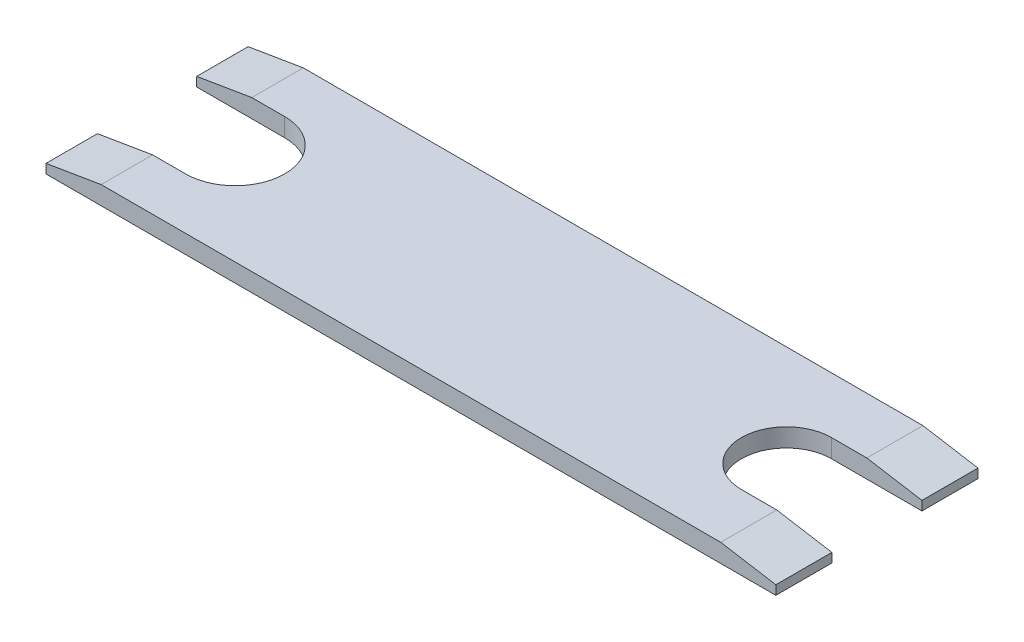
ISO-10303-21;
HEADER;
FILE_DESCRIPTION(('STEP AP214'),'2;1');
FILE_NAME('part.step','',(''),(''),'','','');
FILE_SCHEMA(('AUTOMOTIVE_DESIGN { 1 0 10303 214 1 1 1 1 }'));
ENDSEC;
DATA;
#1=APPLICATION_CONTEXT('core data for automotive mechanical design processes');
#2=APPLICATION_PROTOCOL_DEFINITION('international standard','automotive_design',2000,#1);
#3=PRODUCT_CONTEXT('',#1,'mechanical');
#4=PRODUCT('Part','Part','',(#3));
#5=PRODUCT_RELATED_PRODUCT_CATEGORY('part','',(#4));
#6=PRODUCT_DEFINITION_FORMATION('','',#4);
#7=PRODUCT_DEFINITION_CONTEXT('part definition',#1,'design');
#8=PRODUCT_DEFINITION('design','',#6,#7);
#9=PRODUCT_DEFINITION_SHAPE('','',#8);
#10=(LENGTH_UNIT() NAMED_UNIT(*) SI_UNIT(.MILLI.,.METRE.));
#11=(NAMED_UNIT(*) PLANE_ANGLE_UNIT() SI_UNIT($,.RADIAN.));
#12=(NAMED_UNIT(*) SI_UNIT($,.STERADIAN.) SOLID_ANGLE_UNIT());
#13=UNCERTAINTY_MEASURE_WITH_UNIT(LENGTH_MEASURE(1.E-05),#10,'distance_accuracy_value','');
#14=(GEOMETRIC_REPRESENTATION_CONTEXT(3) GLOBAL_UNCERTAINTY_ASSIGNED_CONTEXT((#13)) GLOBAL_UNIT_ASSIGNED_CONTEXT((#10,
#11,#12)) REPRESENTATION_CONTEXT('',''));
#15=CARTESIAN_POINT('',(0.,0.,0.));
#16=DIRECTION('',(0.,0.,1.));
#17=DIRECTION('',(1.,0.,0.));
#18=AXIS2_PLACEMENT_3D('',#15,#16,#17);
#19=CARTESIAN_POINT('',(-15.,1.,0.));
#20=DIRECTION('',(0.,1.,0.));
#21=DIRECTION('',(0.,0.,1.));
#22=AXIS2_PLACEMENT_3D('',#19,#20,#21);
#23=PLANE('',#22);
#24=DIRECTION('',(1.,0.,0.));
#25=VECTOR('',#24,1.);
#26=CARTESIAN_POINT('',(-15.,1.,5.50000000000001));
#27=LINE('',#26,#25);
#28=CARTESIAN_POINT('',(-16.7916594202843,1.,5.50000000000001));
#29=VERTEX_POINT('',#28);
#30=CARTESIAN_POINT('',(16.9241750578142,1.,5.5));
#31=VERTEX_POINT('',#30);
#32=EDGE_CURVE('E238',#29,#31,#27,.T.);
#33=ORIENTED_EDGE('',*,*,#32,.T.);
#34=DIRECTION('',(0.,0.,-1.));
#35=VECTOR('',#34,1.);
#36=CARTESIAN_POINT('',(16.9241750578142,1.,0.));
#37=LINE('',#36,#35);
#38=CARTESIAN_POINT('',(16.9241750578142,1.,2.45));
#39=VERTEX_POINT('',#38);
#40=EDGE_CURVE('E260',#31,#39,#37,.T.);
#41=ORIENTED_EDGE('',*,*,#40,.T.);
#42=DIRECTION('',(1.,0.,0.));
#43=VECTOR('',#42,1.);
#44=CARTESIAN_POINT('',(15.,1.,2.45));
#45=LINE('',#44,#43);
#46=CARTESIAN_POINT('',(15.,1.,2.45));
#47=VERTEX_POINT('',#46);
#48=EDGE_CURVE('E197',#47,#39,#45,.T.);
#49=ORIENTED_EDGE('',*,*,#48,.F.);
#50=CARTESIAN_POINT('',(15.,1.,0.));
#51=DIRECTION('',(0.,1.,0.));
#52=DIRECTION('',(0.,0.,1.));
#53=AXIS2_PLACEMENT_3D('',#50,#51,#52);
#54=CIRCLE('',#53,2.45);
#55=CARTESIAN_POINT('',(15.,1.,-2.45));
#56=VERTEX_POINT('',#55);
#57=EDGE_CURVE('E227',#56,#47,#54,.T.);
#58=ORIENTED_EDGE('',*,*,#57,.F.);
#59=DIRECTION('',(-1.,0.,0.));
#60=VECTOR('',#59,1.);
#61=CARTESIAN_POINT('',(15.,1.,-2.45));
#62=LINE('',#61,#60);
#63=CARTESIAN_POINT('',(16.9241750578142,1.,-2.45));
#64=VERTEX_POINT('',#63);
#65=EDGE_CURVE('E214',#64,#56,#62,.T.);
#66=ORIENTED_EDGE('',*,*,#65,.F.);
#67=DIRECTION('',(0.,0.,-1.));
#68=VECTOR('',#67,1.);
#69=CARTESIAN_POINT('',(16.9241750578142,1.,0.));
#70=LINE('',#69,#68);
#71=CARTESIAN_POINT('',(16.9241750578142,1.,-5.5));
#72=VERTEX_POINT('',#71);
#73=EDGE_CURVE('E258',#64,#72,#70,.T.);
#74=ORIENTED_EDGE('',*,*,#73,.T.);
#75=DIRECTION('',(-1.,0.,0.));
#76=VECTOR('',#75,1.);
#77=CARTESIAN_POINT('',(-15.,1.,-5.5));
#78=LINE('',#77,#76);
#79=CARTESIAN_POINT('',(-16.7916594202843,1.,-5.5));
#80=VERTEX_POINT('',#79);
#81=EDGE_CURVE('E241',#72,#80,#78,.T.);
#82=ORIENTED_EDGE('',*,*,#81,.T.);
#83=DIRECTION('',(0.,0.,1.));
#84=VECTOR('',#83,1.);
#85=CARTESIAN_POINT('',(-16.7916594202843,1.,0.));
#86=LINE('',#85,#84);
#87=CARTESIAN_POINT('',(-16.7916594202843,1.,-2.7));
#88=VERTEX_POINT('',#87);
#89=EDGE_CURVE('E256',#80,#88,#86,.T.);
#90=ORIENTED_EDGE('',*,*,#89,.T.);
#91=DIRECTION('',(-1.,0.,0.));
#92=VECTOR('',#91,1.);
#93=CARTESIAN_POINT('',(-15.,1.,-2.7));
#94=LINE('',#93,#92);
#95=CARTESIAN_POINT('',(-15.,1.,-2.7));
#96=VERTEX_POINT('',#95);
#97=EDGE_CURVE('E206',#96,#88,#94,.T.);
#98=ORIENTED_EDGE('',*,*,#97,.F.);
#99=CARTESIAN_POINT('',(-15.,1.,0.));
#100=DIRECTION('',(0.,1.,0.));
#101=DIRECTION('',(0.,0.,1.));
#102=AXIS2_PLACEMENT_3D('',#99,#100,#101);
#103=CIRCLE('',#102,2.7);
#104=CARTESIAN_POINT('',(-15.,1.,2.7));
#105=VERTEX_POINT('',#104);
#106=EDGE_CURVE('E232',#105,#96,#103,.T.);
#107=ORIENTED_EDGE('',*,*,#106,.F.);
#108=DIRECTION('',(1.,0.,0.));
#109=VECTOR('',#108,1.);
#110=CARTESIAN_POINT('',(-15.,1.,2.7));
#111=LINE('',#110,#109);
#112=CARTESIAN_POINT('',(-16.7916594202843,1.,2.7));
#113=VERTEX_POINT('',#112);
#114=EDGE_CURVE('E202',#113,#105,#111,.T.);
#115=ORIENTED_EDGE('',*,*,#114,.F.);
#116=DIRECTION('',(0.,0.,1.));
#117=VECTOR('',#116,1.);
#118=CARTESIAN_POINT('',(-16.7916594202843,1.,0.));
#119=LINE('',#118,#117);
#120=EDGE_CURVE('E254',#113,#29,#119,.T.);
#121=ORIENTED_EDGE('',*,*,#120,.T.);
#122=EDGE_LOOP('',(#33,#41,#49,#58,#66,#74,#82,#90,#98,#107,#115,#121));
#123=FACE_BOUND('',#122,.T.);
#124=ADVANCED_FACE('F35',(#123),#23,.T.);
#125=CARTESIAN_POINT('',(-15.,0.,0.));
#126=DIRECTION('',(0.,1.,0.));
#127=DIRECTION('',(0.,0.,1.));
#128=AXIS2_PLACEMENT_3D('',#125,#126,#127);
#129=PLANE('',#128);
#130=DIRECTION('',(1.,0.,0.));
#131=VECTOR('',#130,1.);
#132=CARTESIAN_POINT('',(-15.,0.,5.50000000000001));
#133=LINE('',#132,#131);
#134=CARTESIAN_POINT('',(-19.7916594202844,0.,5.50000000000001));
#135=VERTEX_POINT('',#134);
#136=CARTESIAN_POINT('',(19.9241750578143,0.,5.5));
#137=VERTEX_POINT('',#136);
#138=EDGE_CURVE('E235',#135,#137,#133,.T.);
#139=ORIENTED_EDGE('',*,*,#138,.F.);
#140=DIRECTION('',(0.,0.,-1.));
#141=VECTOR('',#140,1.);
#142=CARTESIAN_POINT('',(-19.7916594202844,0.,2.7));
#143=LINE('',#142,#141);
#144=CARTESIAN_POINT('',(-19.7916594202844,0.,2.7));
#145=VERTEX_POINT('',#144);
#146=EDGE_CURVE('E192',#135,#145,#143,.T.);
#147=ORIENTED_EDGE('',*,*,#146,.T.);
#148=DIRECTION('',(1.,0.,0.));
#149=VECTOR('',#148,1.);
#150=CARTESIAN_POINT('',(-15.,0.,2.7));
#151=LINE('',#150,#149);
#152=CARTESIAN_POINT('',(-15.,0.,2.7));
#153=VERTEX_POINT('',#152);
#154=EDGE_CURVE('E201',#145,#153,#151,.T.);
#155=ORIENTED_EDGE('',*,*,#154,.T.);
#156=CARTESIAN_POINT('',(-15.,0.,0.));
#157=DIRECTION('',(0.,1.,0.));
#158=DIRECTION('',(0.,0.,1.));
#159=AXIS2_PLACEMENT_3D('',#156,#157,#158);
#160=CIRCLE('',#159,2.7);
#161=CARTESIAN_POINT('',(-15.,0.,-2.7));
#162=VERTEX_POINT('',#161);
#163=EDGE_CURVE('E230',#153,#162,#160,.T.);
#164=ORIENTED_EDGE('',*,*,#163,.T.);
#165=DIRECTION('',(-1.,0.,0.));
#166=VECTOR('',#165,1.);
#167=CARTESIAN_POINT('',(-15.,0.,-2.7));
#168=LINE('',#167,#166);
#169=CARTESIAN_POINT('',(-19.7916594202844,0.,-2.7));
#170=VERTEX_POINT('',#169);
#171=EDGE_CURVE('E198',#162,#170,#168,.T.);
#172=ORIENTED_EDGE('',*,*,#171,.T.);
#173=DIRECTION('',(0.,0.,-1.));
#174=VECTOR('',#173,1.);
#175=CARTESIAN_POINT('',(-19.7916594202844,0.,-5.5));
#176=LINE('',#175,#174);
#177=CARTESIAN_POINT('',(-19.7916594202844,0.,-5.5));
#178=VERTEX_POINT('',#177);
#179=EDGE_CURVE('E188',#170,#178,#176,.T.);
#180=ORIENTED_EDGE('',*,*,#179,.T.);
#181=DIRECTION('',(-1.,0.,0.));
#182=VECTOR('',#181,1.);
#183=CARTESIAN_POINT('',(-15.,0.,-5.5));
#184=LINE('',#183,#182);
#185=CARTESIAN_POINT('',(19.9241750578143,0.,-5.5));
#186=VERTEX_POINT('',#185);
#187=EDGE_CURVE('E178',#186,#178,#184,.T.);
#188=ORIENTED_EDGE('',*,*,#187,.F.);
#189=DIRECTION('',(0.,0.,1.));
#190=VECTOR('',#189,1.);
#191=CARTESIAN_POINT('',(19.9241750578143,0.,-2.45));
#192=LINE('',#191,#190);
#193=CARTESIAN_POINT('',(19.9241750578143,0.,-2.45));
#194=VERTEX_POINT('',#193);
#195=EDGE_CURVE('E155',#186,#194,#192,.T.);
#196=ORIENTED_EDGE('',*,*,#195,.T.);
#197=DIRECTION('',(-1.,0.,0.));
#198=VECTOR('',#197,1.);
#199=CARTESIAN_POINT('',(15.,0.,-2.45));
#200=LINE('',#199,#198);
#201=CARTESIAN_POINT('',(15.,0.,-2.45));
#202=VERTEX_POINT('',#201);
#203=EDGE_CURVE('E163',#194,#202,#200,.T.);
#204=ORIENTED_EDGE('',*,*,#203,.T.);
#205=CARTESIAN_POINT('',(15.,0.,0.));
#206=DIRECTION('',(0.,1.,0.));
#207=DIRECTION('',(0.,0.,1.));
#208=AXIS2_PLACEMENT_3D('',#205,#206,#207);
#209=CIRCLE('',#208,2.45);
#210=CARTESIAN_POINT('',(15.,0.,2.45));
#211=VERTEX_POINT('',#210);
#212=EDGE_CURVE('E226',#202,#211,#209,.T.);
#213=ORIENTED_EDGE('',*,*,#212,.T.);
#214=DIRECTION('',(1.,0.,0.));
#215=VECTOR('',#214,1.);
#216=CARTESIAN_POINT('',(15.,0.,2.45));
#217=LINE('',#216,#215);
#218=CARTESIAN_POINT('',(19.9241750578143,0.,2.45));
#219=VERTEX_POINT('',#218);
#220=EDGE_CURVE('E171',#211,#219,#217,.T.);
#221=ORIENTED_EDGE('',*,*,#220,.T.);
#222=DIRECTION('',(0.,0.,1.));
#223=VECTOR('',#222,1.);
#224=CARTESIAN_POINT('',(19.9241750578143,0.,5.5));
#225=LINE('',#224,#223);
#226=EDGE_CURVE('E181',#219,#137,#225,.T.);
#227=ORIENTED_EDGE('',*,*,#226,.T.);
#228=EDGE_LOOP('',(#139,#147,#155,#164,#172,#180,#188,#196,#204,#213,#221,#227));
#229=FACE_BOUND('',#228,.T.);
#230=ADVANCED_FACE('F175',(#229),#129,.F.);
#231=CARTESIAN_POINT('',(-15.,1.,5.50000000000001));
#232=DIRECTION('',(0.,0.,-1.));
#233=DIRECTION('',(-1.,0.,0.));
#234=AXIS2_PLACEMENT_3D('',#231,#232,#233);
#235=PLANE('',#234);
#236=DIRECTION('',(0.,-1.,0.));
#237=VECTOR('',#236,1.);
#238=CARTESIAN_POINT('',(19.9241750578143,6.79223618302984,5.5));
#239=LINE('',#238,#237);
#240=CARTESIAN_POINT('',(19.9241750578143,0.5,5.5));
#241=VERTEX_POINT('',#240);
#242=EDGE_CURVE('E186',#241,#137,#239,.T.);
#243=ORIENTED_EDGE('',*,*,#242,.F.);
#244=DIRECTION('',(0.986393923832144,-0.164398987305354,0.));
#245=VECTOR('',#244,1.);
#246=CARTESIAN_POINT('',(19.9241750578143,0.5,5.5));
#247=LINE('',#246,#245);
#248=EDGE_CURVE('E252',#241,#31,#247,.F.);
#249=ORIENTED_EDGE('',*,*,#248,.T.);
#250=ORIENTED_EDGE('',*,*,#32,.F.);
#251=DIRECTION('',(0.986393923832144,0.164398987305354,0.));
#252=VECTOR('',#251,1.);
#253=CARTESIAN_POINT('',(-19.7916594202844,0.5,5.50000000000001));
#254=LINE('',#253,#252);
#255=CARTESIAN_POINT('',(-19.7916594202844,0.5,5.50000000000001));
#256=VERTEX_POINT('',#255);
#257=EDGE_CURVE('E250',#29,#256,#254,.F.);
#258=ORIENTED_EDGE('',*,*,#257,.T.);
#259=DIRECTION('',(0.,-1.,0.));
#260=VECTOR('',#259,1.);
#261=CARTESIAN_POINT('',(-19.7916594202844,6.79223618302984,5.50000000000001));
#262=LINE('',#261,#260);
#263=EDGE_CURVE('E195',#256,#135,#262,.T.);
#264=ORIENTED_EDGE('',*,*,#263,.T.);
#265=ORIENTED_EDGE('',*,*,#138,.T.);
#266=EDGE_LOOP('',(#243,#249,#250,#258,#264,#265));
#267=FACE_BOUND('',#266,.T.);
#268=ADVANCED_FACE('F288',(#267),#235,.F.);
#269=CARTESIAN_POINT('',(-15.,1.,-5.5));
#270=DIRECTION('',(0.,0.,1.));
#271=DIRECTION('',(1.,0.,0.));
#272=AXIS2_PLACEMENT_3D('',#269,#270,#271);
#273=PLANE('',#272);
#274=ORIENTED_EDGE('',*,*,#81,.F.);
#275=DIRECTION('',(-0.986393923832144,0.164398987305354,0.));
#276=VECTOR('',#275,1.);
#277=CARTESIAN_POINT('',(19.9241750578143,0.5,-5.5));
#278=LINE('',#277,#276);
#279=CARTESIAN_POINT('',(19.9241750578143,0.5,-5.5));
#280=VERTEX_POINT('',#279);
#281=EDGE_CURVE('E269',#72,#280,#278,.F.);
#282=ORIENTED_EDGE('',*,*,#281,.T.);
#283=DIRECTION('',(0.,-1.,0.));
#284=VECTOR('',#283,1.);
#285=CARTESIAN_POINT('',(19.9241750578143,6.79223618302984,-5.5));
#286=LINE('',#285,#284);
#287=EDGE_CURVE('E179',#280,#186,#286,.T.);
#288=ORIENTED_EDGE('',*,*,#287,.T.);
#289=ORIENTED_EDGE('',*,*,#187,.T.);
#290=DIRECTION('',(0.,-1.,0.));
#291=VECTOR('',#290,1.);
#292=CARTESIAN_POINT('',(-19.7916594202844,6.79223618302984,-5.5));
#293=LINE('',#292,#291);
#294=CARTESIAN_POINT('',(-19.7916594202844,0.5,-5.5));
#295=VERTEX_POINT('',#294);
#296=EDGE_CURVE('E190',#295,#178,#293,.T.);
#297=ORIENTED_EDGE('',*,*,#296,.F.);
#298=DIRECTION('',(-0.986393923832144,-0.164398987305354,0.));
#299=VECTOR('',#298,1.);
#300=CARTESIAN_POINT('',(-19.7916594202844,0.5,-5.5));
#301=LINE('',#300,#299);
#302=EDGE_CURVE('E267',#295,#80,#301,.F.);
#303=ORIENTED_EDGE('',*,*,#302,.T.);
#304=EDGE_LOOP('',(#274,#282,#288,#289,#297,#303));
#305=FACE_BOUND('',#304,.T.);
#306=ADVANCED_FACE('F304',(#305),#273,.F.);
#307=CARTESIAN_POINT('',(-15.,1.,0.));
#308=DIRECTION('',(0.,-1.,0.));
#309=DIRECTION('',(0.,0.,-1.));
#310=AXIS2_PLACEMENT_3D('',#307,#308,#309);
#311=CYLINDRICAL_SURFACE('',#310,2.7);
#312=DIRECTION('',(0.,1.,0.));
#313=VECTOR('',#312,1.);
#314=CARTESIAN_POINT('',(-15.,0.,2.7));
#315=LINE('',#314,#313);
#316=EDGE_CURVE('E209',#153,#105,#315,.T.);
#317=ORIENTED_EDGE('',*,*,#316,.T.);
#318=ORIENTED_EDGE('',*,*,#106,.T.);
#319=DIRECTION('',(0.,1.,0.));
#320=VECTOR('',#319,1.);
#321=CARTESIAN_POINT('',(-15.,0.,-2.7));
#322=LINE('',#321,#320);
#323=EDGE_CURVE('E205',#162,#96,#322,.T.);
#324=ORIENTED_EDGE('',*,*,#323,.F.);
#325=ORIENTED_EDGE('',*,*,#163,.F.);
#326=EDGE_LOOP('',(#317,#318,#324,#325));
#327=FACE_BOUND('',#326,.T.);
#328=ADVANCED_FACE('F295',(#327),#311,.F.);
#329=CARTESIAN_POINT('',(15.,1.,0.));
#330=DIRECTION('',(0.,-1.,0.));
#331=DIRECTION('',(0.,0.,-1.));
#332=AXIS2_PLACEMENT_3D('',#329,#330,#331);
#333=CYLINDRICAL_SURFACE('',#332,2.45);
#334=DIRECTION('',(0.,1.,0.));
#335=VECTOR('',#334,1.);
#336=CARTESIAN_POINT('',(15.,0.,-2.45));
#337=LINE('',#336,#335);
#338=EDGE_CURVE('E166',#202,#56,#337,.T.);
#339=ORIENTED_EDGE('',*,*,#338,.T.);
#340=ORIENTED_EDGE('',*,*,#57,.T.);
#341=DIRECTION('',(0.,1.,0.));
#342=VECTOR('',#341,1.);
#343=CARTESIAN_POINT('',(15.,0.,2.45));
#344=LINE('',#343,#342);
#345=EDGE_CURVE('E170',#211,#47,#344,.T.);
#346=ORIENTED_EDGE('',*,*,#345,.F.);
#347=ORIENTED_EDGE('',*,*,#212,.F.);
#348=EDGE_LOOP('',(#339,#340,#346,#347));
#349=FACE_BOUND('',#348,.T.);
#350=ADVANCED_FACE('F314',(#349),#333,.F.);
#351=CARTESIAN_POINT('',(15.,0.,2.45));
#352=DIRECTION('',(0.,0.,1.));
#353=DIRECTION('',(1.,0.,0.));
#354=AXIS2_PLACEMENT_3D('',#351,#352,#353);
#355=PLANE('',#354);
#356=ORIENTED_EDGE('',*,*,#48,.T.);
#357=DIRECTION('',(-0.986393923832144,0.164398987305354,0.));
#358=VECTOR('',#357,1.);
#359=CARTESIAN_POINT('',(19.9241750578143,0.5,2.45));
#360=LINE('',#359,#358);
#361=CARTESIAN_POINT('',(19.9241750578143,0.5,2.45));
#362=VERTEX_POINT('',#361);
#363=EDGE_CURVE('E262',#39,#362,#360,.F.);
#364=ORIENTED_EDGE('',*,*,#363,.T.);
#365=DIRECTION('',(0.,-1.,0.));
#366=VECTOR('',#365,1.);
#367=CARTESIAN_POINT('',(19.9241750578143,1.,2.45));
#368=LINE('',#367,#366);
#369=EDGE_CURVE('E160',#219,#362,#368,.F.);
#370=ORIENTED_EDGE('',*,*,#369,.F.);
#371=ORIENTED_EDGE('',*,*,#220,.F.);
#372=ORIENTED_EDGE('',*,*,#345,.T.);
#373=EDGE_LOOP('',(#356,#364,#370,#371,#372));
#374=FACE_BOUND('',#373,.T.);
#375=ADVANCED_FACE('F322',(#374),#355,.F.);
#376=CARTESIAN_POINT('',(15.,0.,-2.45));
#377=DIRECTION('',(0.,0.,-1.));
#378=DIRECTION('',(-1.,0.,0.));
#379=AXIS2_PLACEMENT_3D('',#376,#377,#378);
#380=PLANE('',#379);
#381=DIRECTION('',(0.,-1.,0.));
#382=VECTOR('',#381,1.);
#383=CARTESIAN_POINT('',(19.9241750578143,1.,-2.45));
#384=LINE('',#383,#382);
#385=CARTESIAN_POINT('',(19.9241750578143,0.5,-2.45));
#386=VERTEX_POINT('',#385);
#387=EDGE_CURVE('E150',#386,#194,#384,.T.);
#388=ORIENTED_EDGE('',*,*,#387,.F.);
#389=DIRECTION('',(0.986393923832144,-0.164398987305354,0.));
#390=VECTOR('',#389,1.);
#391=CARTESIAN_POINT('',(19.9241750578143,0.5,-2.45));
#392=LINE('',#391,#390);
#393=EDGE_CURVE('E265',#386,#64,#392,.F.);
#394=ORIENTED_EDGE('',*,*,#393,.T.);
#395=ORIENTED_EDGE('',*,*,#65,.T.);
#396=ORIENTED_EDGE('',*,*,#338,.F.);
#397=ORIENTED_EDGE('',*,*,#203,.F.);
#398=EDGE_LOOP('',(#388,#394,#395,#396,#397));
#399=FACE_BOUND('',#398,.T.);
#400=ADVANCED_FACE('F164',(#399),#380,.F.);
#401=CARTESIAN_POINT('',(-15.,0.,-2.7));
#402=DIRECTION('',(0.,0.,-1.));
#403=DIRECTION('',(-1.,0.,0.));
#404=AXIS2_PLACEMENT_3D('',#401,#402,#403);
#405=PLANE('',#404);
#406=ORIENTED_EDGE('',*,*,#97,.T.);
#407=DIRECTION('',(0.986393923832144,0.164398987305354,0.));
#408=VECTOR('',#407,1.);
#409=CARTESIAN_POINT('',(-19.7916594202844,0.5,-2.7));
#410=LINE('',#409,#408);
#411=CARTESIAN_POINT('',(-19.7916594202844,0.5,-2.7));
#412=VERTEX_POINT('',#411);
#413=EDGE_CURVE('E57',#88,#412,#410,.F.);
#414=ORIENTED_EDGE('',*,*,#413,.T.);
#415=DIRECTION('',(0.,-1.,0.));
#416=VECTOR('',#415,1.);
#417=CARTESIAN_POINT('',(-19.7916594202844,1.,-2.7));
#418=LINE('',#417,#416);
#419=EDGE_CURVE('E159',#170,#412,#418,.F.);
#420=ORIENTED_EDGE('',*,*,#419,.F.);
#421=ORIENTED_EDGE('',*,*,#171,.F.);
#422=ORIENTED_EDGE('',*,*,#323,.T.);
#423=EDGE_LOOP('',(#406,#414,#420,#421,#422));
#424=FACE_BOUND('',#423,.T.);
#425=ADVANCED_FACE('F329',(#424),#405,.F.);
#426=CARTESIAN_POINT('',(-15.,0.,2.7));
#427=DIRECTION('',(0.,0.,1.));
#428=DIRECTION('',(1.,0.,0.));
#429=AXIS2_PLACEMENT_3D('',#426,#427,#428);
#430=PLANE('',#429);
#431=DIRECTION('',(0.,-1.,0.));
#432=VECTOR('',#431,1.);
#433=CARTESIAN_POINT('',(-19.7916594202844,1.,2.7));
#434=LINE('',#433,#432);
#435=CARTESIAN_POINT('',(-19.7916594202844,0.5,2.7));
#436=VERTEX_POINT('',#435);
#437=EDGE_CURVE('E224',#436,#145,#434,.T.);
#438=ORIENTED_EDGE('',*,*,#437,.F.);
#439=DIRECTION('',(-0.986393923832144,-0.164398987305354,0.));
#440=VECTOR('',#439,1.);
#441=CARTESIAN_POINT('',(-19.7916594202844,0.5,2.7));
#442=LINE('',#441,#440);
#443=EDGE_CURVE('E11',#436,#113,#442,.F.);
#444=ORIENTED_EDGE('',*,*,#443,.T.);
#445=ORIENTED_EDGE('',*,*,#114,.T.);
#446=ORIENTED_EDGE('',*,*,#316,.F.);
#447=ORIENTED_EDGE('',*,*,#154,.F.);
#448=EDGE_LOOP('',(#438,#444,#445,#446,#447));
#449=FACE_BOUND('',#448,.T.);
#450=ADVANCED_FACE('F282',(#449),#430,.F.);
#451=CARTESIAN_POINT('',(-19.7916594202844,6.79223618302984,2.7));
#452=DIRECTION('',(-1.,0.,0.));
#453=DIRECTION('',(0.,0.,1.));
#454=AXIS2_PLACEMENT_3D('',#451,#452,#453);
#455=PLANE('',#454);
#456=ORIENTED_EDGE('',*,*,#263,.F.);
#457=DIRECTION('',(0.,0.,-1.));
#458=VECTOR('',#457,1.);
#459=CARTESIAN_POINT('',(-19.7916594202844,0.5,2.7));
#460=LINE('',#459,#458);
#461=EDGE_CURVE('E44',#256,#436,#460,.T.);
#462=ORIENTED_EDGE('',*,*,#461,.T.);
#463=ORIENTED_EDGE('',*,*,#437,.T.);
#464=ORIENTED_EDGE('',*,*,#146,.F.);
#465=EDGE_LOOP('',(#456,#462,#463,#464));
#466=FACE_BOUND('',#465,.T.);
#467=ADVANCED_FACE('F277',(#466),#455,.T.);
#468=CARTESIAN_POINT('',(-19.7916594202844,6.79223618302984,-5.5));
#469=DIRECTION('',(-1.,0.,0.));
#470=DIRECTION('',(0.,0.,1.));
#471=AXIS2_PLACEMENT_3D('',#468,#469,#470);
#472=PLANE('',#471);
#473=ORIENTED_EDGE('',*,*,#419,.T.);
#474=DIRECTION('',(0.,0.,-1.));
#475=VECTOR('',#474,1.);
#476=CARTESIAN_POINT('',(-19.7916594202844,0.5,-5.5));
#477=LINE('',#476,#475);
#478=EDGE_CURVE('E271',#412,#295,#477,.T.);
#479=ORIENTED_EDGE('',*,*,#478,.T.);
#480=ORIENTED_EDGE('',*,*,#296,.T.);
#481=ORIENTED_EDGE('',*,*,#179,.F.);
#482=EDGE_LOOP('',(#473,#479,#480,#481));
#483=FACE_BOUND('',#482,.T.);
#484=ADVANCED_FACE('F299',(#483),#472,.T.);
#485=CARTESIAN_POINT('',(19.9241750578143,6.79223618302984,5.5));
#486=DIRECTION('',(1.,0.,0.));
#487=DIRECTION('',(0.,0.,-1.));
#488=AXIS2_PLACEMENT_3D('',#485,#486,#487);
#489=PLANE('',#488);
#490=ORIENTED_EDGE('',*,*,#369,.T.);
#491=DIRECTION('',(0.,0.,1.));
#492=VECTOR('',#491,1.);
#493=CARTESIAN_POINT('',(19.9241750578143,0.5,5.5));
#494=LINE('',#493,#492);
#495=EDGE_CURVE('E244',#362,#241,#494,.T.);
#496=ORIENTED_EDGE('',*,*,#495,.T.);
#497=ORIENTED_EDGE('',*,*,#242,.T.);
#498=ORIENTED_EDGE('',*,*,#226,.F.);
#499=EDGE_LOOP('',(#490,#496,#497,#498));
#500=FACE_BOUND('',#499,.T.);
#501=ADVANCED_FACE('F317',(#500),#489,.T.);
#502=CARTESIAN_POINT('',(19.9241750578143,6.79223618302984,-2.45));
#503=DIRECTION('',(1.,0.,0.));
#504=DIRECTION('',(0.,0.,-1.));
#505=AXIS2_PLACEMENT_3D('',#502,#503,#504);
#506=PLANE('',#505);
#507=ORIENTED_EDGE('',*,*,#287,.F.);
#508=DIRECTION('',(0.,0.,1.));
#509=VECTOR('',#508,1.);
#510=CARTESIAN_POINT('',(19.9241750578143,0.5,-2.45));
#511=LINE('',#510,#509);
#512=EDGE_CURVE('E157',#280,#386,#511,.T.);
#513=ORIENTED_EDGE('',*,*,#512,.T.);
#514=ORIENTED_EDGE('',*,*,#387,.T.);
#515=ORIENTED_EDGE('',*,*,#195,.F.);
#516=EDGE_LOOP('',(#507,#513,#514,#515));
#517=FACE_BOUND('',#516,.T.);
#518=ADVANCED_FACE('F153',(#517),#506,.T.);
#519=CARTESIAN_POINT('',(19.9241750578143,0.5,5.5));
#520=DIRECTION('',(-0.164398987305354,-0.986393923832144,0.));
#521=DIRECTION('',(0.,0.,1.));
#522=AXIS2_PLACEMENT_3D('',#519,#520,#521);
#523=PLANE('',#522);
#524=ORIENTED_EDGE('',*,*,#363,.F.);
#525=ORIENTED_EDGE('',*,*,#40,.F.);
#526=ORIENTED_EDGE('',*,*,#248,.F.);
#527=ORIENTED_EDGE('',*,*,#495,.F.);
#528=EDGE_LOOP('',(#524,#525,#526,#527));
#529=FACE_BOUND('',#528,.T.);
#530=ADVANCED_FACE('F321',(#529),#523,.F.);
#531=CARTESIAN_POINT('',(19.9241750578143,0.5,-2.45));
#532=DIRECTION('',(-0.164398987305354,-0.986393923832144,0.));
#533=DIRECTION('',(0.,0.,1.));
#534=AXIS2_PLACEMENT_3D('',#531,#532,#533);
#535=PLANE('',#534);
#536=ORIENTED_EDGE('',*,*,#281,.F.);
#537=ORIENTED_EDGE('',*,*,#73,.F.);
#538=ORIENTED_EDGE('',*,*,#393,.F.);
#539=ORIENTED_EDGE('',*,*,#512,.F.);
#540=EDGE_LOOP('',(#536,#537,#538,#539));
#541=FACE_BOUND('',#540,.T.);
#542=ADVANCED_FACE('F307',(#541),#535,.F.);
#543=CARTESIAN_POINT('',(-19.7916594202844,0.5,-5.5));
#544=DIRECTION('',(0.164398987305354,-0.986393923832144,0.));
#545=DIRECTION('',(0.,0.,-1.));
#546=AXIS2_PLACEMENT_3D('',#543,#544,#545);
#547=PLANE('',#546);
#548=ORIENTED_EDGE('',*,*,#413,.F.);
#549=ORIENTED_EDGE('',*,*,#89,.F.);
#550=ORIENTED_EDGE('',*,*,#302,.F.);
#551=ORIENTED_EDGE('',*,*,#478,.F.);
#552=EDGE_LOOP('',(#548,#549,#550,#551));
#553=FACE_BOUND('',#552,.T.);
#554=ADVANCED_FACE('F354',(#553),#547,.F.);
#555=CARTESIAN_POINT('',(-19.7916594202844,0.5,2.7));
#556=DIRECTION('',(0.164398987305354,-0.986393923832144,0.));
#557=DIRECTION('',(0.,0.,-1.));
#558=AXIS2_PLACEMENT_3D('',#555,#556,#557);
#559=PLANE('',#558);
#560=ORIENTED_EDGE('',*,*,#257,.F.);
#561=ORIENTED_EDGE('',*,*,#120,.F.);
#562=ORIENTED_EDGE('',*,*,#443,.F.);
#563=ORIENTED_EDGE('',*,*,#461,.F.);
#564=EDGE_LOOP('',(#560,#561,#562,#563));
#565=FACE_BOUND('',#564,.T.);
#566=ADVANCED_FACE('F38',(#565),#559,.F.);
#567=CLOSED_SHELL('',(#124,#230,#268,#306,#328,#350,#375,#400,#425,#450,#467,#484,#501,#518,
#530,#542,#554,#566));
#568=MANIFOLD_SOLID_BREP('B2',#567);
#569=ADVANCED_BREP_SHAPE_REPRESENTATION('',(#18,#568),#14);
#570=SHAPE_DEFINITION_REPRESENTATION(#9,#569);
ENDSEC;
END-ISO-10303-21;
